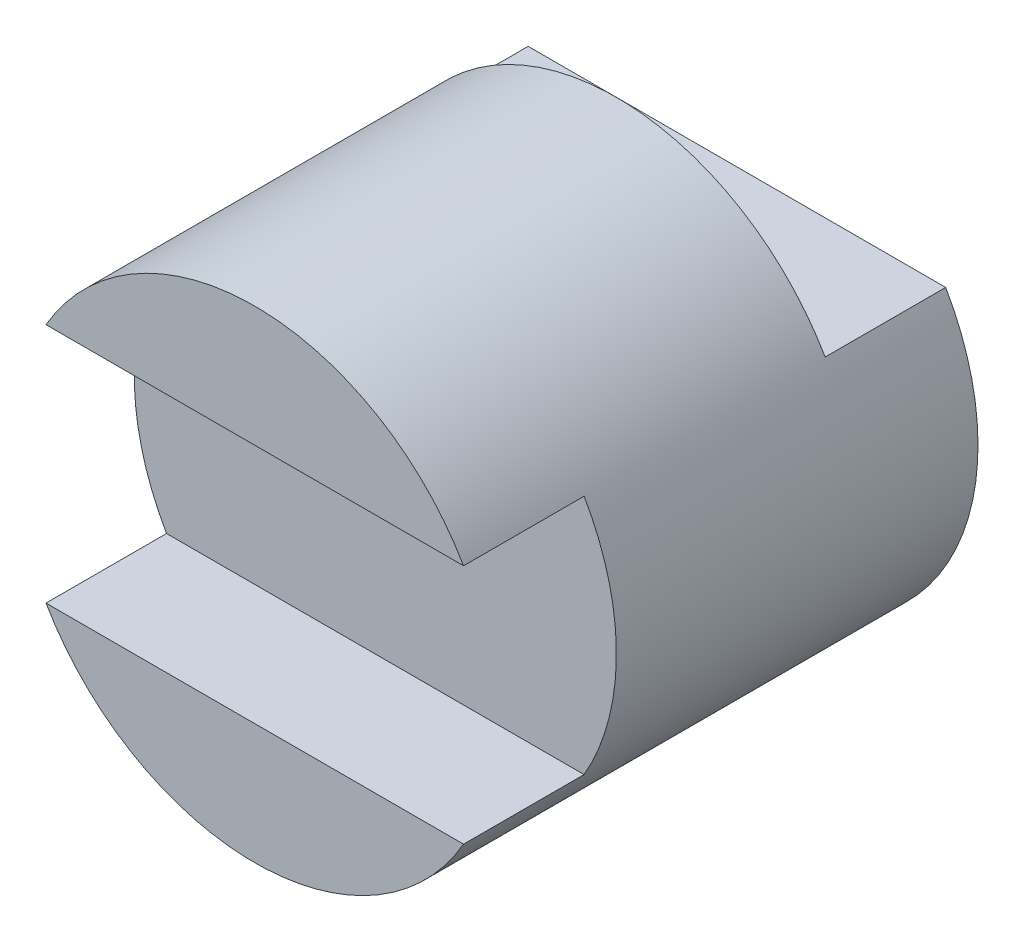
ISO-10303-21;
HEADER;
FILE_DESCRIPTION(('STEP AP214'),'2;1');
FILE_NAME('part.step','',(''),(''),'','','');
FILE_SCHEMA(('AUTOMOTIVE_DESIGN { 1 0 10303 214 1 1 1 1 }'));
ENDSEC;
DATA;
#1=APPLICATION_CONTEXT('core data for automotive mechanical design processes');
#2=APPLICATION_PROTOCOL_DEFINITION('international standard','automotive_design',2000,#1);
#3=PRODUCT_CONTEXT('',#1,'mechanical');
#4=PRODUCT('Part','Part','',(#3));
#5=PRODUCT_RELATED_PRODUCT_CATEGORY('part','',(#4));
#6=PRODUCT_DEFINITION_FORMATION('','',#4);
#7=PRODUCT_DEFINITION_CONTEXT('part definition',#1,'design');
#8=PRODUCT_DEFINITION('design','',#6,#7);
#9=PRODUCT_DEFINITION_SHAPE('','',#8);
#10=(LENGTH_UNIT() NAMED_UNIT(*) SI_UNIT(.MILLI.,.METRE.));
#11=(NAMED_UNIT(*) PLANE_ANGLE_UNIT() SI_UNIT($,.RADIAN.));
#12=(NAMED_UNIT(*) SI_UNIT($,.STERADIAN.) SOLID_ANGLE_UNIT());
#13=UNCERTAINTY_MEASURE_WITH_UNIT(LENGTH_MEASURE(1.E-05),#10,'distance_accuracy_value','');
#14=(GEOMETRIC_REPRESENTATION_CONTEXT(3) GLOBAL_UNCERTAINTY_ASSIGNED_CONTEXT((#13)) GLOBAL_UNIT_ASSIGNED_CONTEXT((#10,
#11,#12)) REPRESENTATION_CONTEXT('',''));
#15=CARTESIAN_POINT('',(0.,0.,0.));
#16=DIRECTION('',(0.,0.,1.));
#17=DIRECTION('',(1.,0.,0.));
#18=AXIS2_PLACEMENT_3D('',#15,#16,#17);
#19=CARTESIAN_POINT('',(0.,0.,3.));
#20=DIRECTION('',(0.,0.,1.));
#21=DIRECTION('',(1.,0.,0.));
#22=AXIS2_PLACEMENT_3D('',#19,#20,#21);
#23=PLANE('',#22);
#24=CARTESIAN_POINT('',(0.,0.,3.));
#25=DIRECTION('',(0.,0.,1.));
#26=DIRECTION('',(1.,0.,0.));
#27=AXIS2_PLACEMENT_3D('',#24,#25,#26);
#28=CIRCLE('',#27,2.);
#29=CARTESIAN_POINT('',(-1.73205080756888,1.,3.));
#30=VERTEX_POINT('',#29);
#31=CARTESIAN_POINT('',(-1.73205080756888,-1.,3.));
#32=VERTEX_POINT('',#31);
#33=EDGE_CURVE('E11',#30,#32,#28,.T.);
#34=ORIENTED_EDGE('',*,*,#33,.T.);
#35=DIRECTION('',(-1.,0.,0.));
#36=VECTOR('',#35,1.);
#37=CARTESIAN_POINT('',(1.73205080756888,-1.,3.));
#38=LINE('',#37,#36);
#39=CARTESIAN_POINT('',(1.73205080756888,-1.,3.));
#40=VERTEX_POINT('',#39);
#41=EDGE_CURVE('E97',#40,#32,#38,.T.);
#42=ORIENTED_EDGE('',*,*,#41,.F.);
#43=CARTESIAN_POINT('',(1.73205080756888,1.,3.));
#44=VERTEX_POINT('',#43);
#45=EDGE_CURVE('E42',#40,#44,#28,.T.);
#46=ORIENTED_EDGE('',*,*,#45,.T.);
#47=DIRECTION('',(1.,0.,0.));
#48=VECTOR('',#47,1.);
#49=CARTESIAN_POINT('',(-1.73205080756888,1.,3.));
#50=LINE('',#49,#48);
#51=EDGE_CURVE('E117',#30,#44,#50,.T.);
#52=ORIENTED_EDGE('',*,*,#51,.F.);
#53=EDGE_LOOP('',(#34,#42,#46,#52));
#54=FACE_BOUND('',#53,.T.);
#55=ADVANCED_FACE('F33',(#54),#23,.T.);
#56=CARTESIAN_POINT('',(0.,0.,3.));
#57=DIRECTION('',(0.,0.,-1.));
#58=DIRECTION('',(-1.,0.,0.));
#59=AXIS2_PLACEMENT_3D('',#56,#57,#58);
#60=CYLINDRICAL_SURFACE('',#59,2.);
#61=ORIENTED_EDGE('',*,*,#33,.F.);
#62=DIRECTION('',(0.,0.,-1.));
#63=VECTOR('',#62,1.);
#64=CARTESIAN_POINT('',(-1.73205080756888,1.,4.));
#65=LINE('',#64,#63);
#66=CARTESIAN_POINT('',(-1.73205080756888,1.,4.));
#67=VERTEX_POINT('',#66);
#68=EDGE_CURVE('E128',#67,#30,#65,.T.);
#69=ORIENTED_EDGE('',*,*,#68,.F.);
#70=CARTESIAN_POINT('',(0.,0.,4.));
#71=DIRECTION('',(0.,0.,1.));
#72=DIRECTION('',(-1.,0.,0.));
#73=AXIS2_PLACEMENT_3D('',#70,#71,#72);
#74=CIRCLE('',#73,2.);
#75=CARTESIAN_POINT('',(1.73205080756888,1.,4.));
#76=VERTEX_POINT('',#75);
#77=EDGE_CURVE('E119',#76,#67,#74,.T.);
#78=ORIENTED_EDGE('',*,*,#77,.F.);
#79=DIRECTION('',(0.,0.,-1.));
#80=VECTOR('',#79,1.);
#81=CARTESIAN_POINT('',(1.73205080756888,1.,4.));
#82=LINE('',#81,#80);
#83=EDGE_CURVE('E124',#76,#44,#82,.T.);
#84=ORIENTED_EDGE('',*,*,#83,.T.);
#85=ORIENTED_EDGE('',*,*,#45,.F.);
#86=DIRECTION('',(0.,0.,-1.));
#87=VECTOR('',#86,1.);
#88=CARTESIAN_POINT('',(1.73205080756888,-1.,4.));
#89=LINE('',#88,#87);
#90=CARTESIAN_POINT('',(1.73205080756888,-1.,4.));
#91=VERTEX_POINT('',#90);
#92=EDGE_CURVE('E49',#91,#40,#89,.T.);
#93=ORIENTED_EDGE('',*,*,#92,.F.);
#94=CARTESIAN_POINT('',(0.,0.,4.));
#95=DIRECTION('',(0.,0.,1.));
#96=DIRECTION('',(1.,0.,0.));
#97=AXIS2_PLACEMENT_3D('',#94,#95,#96);
#98=CIRCLE('',#97,2.);
#99=CARTESIAN_POINT('',(-1.73205080756888,-1.,4.));
#100=VERTEX_POINT('',#99);
#101=EDGE_CURVE('E93',#100,#91,#98,.T.);
#102=ORIENTED_EDGE('',*,*,#101,.F.);
#103=DIRECTION('',(0.,0.,-1.));
#104=VECTOR('',#103,1.);
#105=CARTESIAN_POINT('',(-1.73205080756888,-1.,4.));
#106=LINE('',#105,#104);
#107=EDGE_CURVE('E90',#100,#32,#106,.T.);
#108=ORIENTED_EDGE('',*,*,#107,.T.);
#109=EDGE_LOOP('',(#61,#69,#78,#84,#85,#93,#102,#108));
#110=FACE_BOUND('',#109,.T.);
#111=CARTESIAN_POINT('',(0.,0.,1.));
#112=DIRECTION('',(0.,0.,-1.));
#113=DIRECTION('',(-1.,0.,0.));
#114=AXIS2_PLACEMENT_3D('',#111,#112,#113);
#115=CIRCLE('',#114,2.);
#116=CARTESIAN_POINT('',(-1.73205080756888,1.,1.));
#117=VERTEX_POINT('',#116);
#118=CARTESIAN_POINT('',(1.73205080756888,1.,1.));
#119=VERTEX_POINT('',#118);
#120=EDGE_CURVE('E105',#117,#119,#115,.T.);
#121=ORIENTED_EDGE('',*,*,#120,.F.);
#122=DIRECTION('',(0.,0.,-1.));
#123=VECTOR('',#122,1.);
#124=CARTESIAN_POINT('',(-1.73205080756888,1.,1.));
#125=LINE('',#124,#123);
#126=CARTESIAN_POINT('',(-1.73205080756888,1.,0.));
#127=VERTEX_POINT('',#126);
#128=EDGE_CURVE('E114',#117,#127,#125,.T.);
#129=ORIENTED_EDGE('',*,*,#128,.T.);
#130=CARTESIAN_POINT('',(0.,0.,0.));
#131=DIRECTION('',(0.,0.,1.));
#132=DIRECTION('',(1.,0.,0.));
#133=AXIS2_PLACEMENT_3D('',#130,#131,#132);
#134=CIRCLE('',#133,2.);
#135=CARTESIAN_POINT('',(1.73205080756888,1.,0.));
#136=VERTEX_POINT('',#135);
#137=EDGE_CURVE('E37',#127,#136,#134,.T.);
#138=ORIENTED_EDGE('',*,*,#137,.T.);
#139=DIRECTION('',(0.,0.,-1.));
#140=VECTOR('',#139,1.);
#141=CARTESIAN_POINT('',(1.73205080756888,1.,1.));
#142=LINE('',#141,#140);
#143=EDGE_CURVE('E57',#119,#136,#142,.T.);
#144=ORIENTED_EDGE('',*,*,#143,.F.);
#145=EDGE_LOOP('',(#121,#129,#138,#144));
#146=FACE_BOUND('',#145,.T.);
#147=ADVANCED_FACE('F35',(#110,#146),#60,.T.);
#148=CARTESIAN_POINT('',(0.,0.,0.));
#149=DIRECTION('',(0.,0.,1.));
#150=DIRECTION('',(1.,0.,0.));
#151=AXIS2_PLACEMENT_3D('',#148,#149,#150);
#152=PLANE('',#151);
#153=ORIENTED_EDGE('',*,*,#137,.F.);
#154=DIRECTION('',(-1.,0.,0.));
#155=VECTOR('',#154,1.);
#156=CARTESIAN_POINT('',(-1.73205080756888,1.,0.));
#157=LINE('',#156,#155);
#158=EDGE_CURVE('E103',#136,#127,#157,.T.);
#159=ORIENTED_EDGE('',*,*,#158,.F.);
#160=EDGE_LOOP('',(#153,#159));
#161=FACE_BOUND('',#160,.T.);
#162=ADVANCED_FACE('F149',(#161),#152,.F.);
#163=CARTESIAN_POINT('',(-1.73205080756888,1.,4.));
#164=DIRECTION('',(0.,1.,0.));
#165=DIRECTION('',(0.,0.,1.));
#166=AXIS2_PLACEMENT_3D('',#163,#164,#165);
#167=PLANE('',#166);
#168=ORIENTED_EDGE('',*,*,#51,.T.);
#169=ORIENTED_EDGE('',*,*,#83,.F.);
#170=DIRECTION('',(1.,0.,0.));
#171=VECTOR('',#170,1.);
#172=CARTESIAN_POINT('',(-1.73205080756888,1.,4.));
#173=LINE('',#172,#171);
#174=EDGE_CURVE('E122',#67,#76,#173,.T.);
#175=ORIENTED_EDGE('',*,*,#174,.F.);
#176=ORIENTED_EDGE('',*,*,#68,.T.);
#177=EDGE_LOOP('',(#168,#169,#175,#176));
#178=FACE_BOUND('',#177,.T.);
#179=ADVANCED_FACE('F136',(#178),#167,.F.);
#180=CARTESIAN_POINT('',(0.,0.,4.));
#181=DIRECTION('',(0.,0.,-1.));
#182=DIRECTION('',(-1.,0.,0.));
#183=AXIS2_PLACEMENT_3D('',#180,#181,#182);
#184=PLANE('',#183);
#185=ORIENTED_EDGE('',*,*,#77,.T.);
#186=ORIENTED_EDGE('',*,*,#174,.T.);
#187=EDGE_LOOP('',(#185,#186));
#188=FACE_BOUND('',#187,.T.);
#189=ADVANCED_FACE('F139',(#188),#184,.F.);
#190=CARTESIAN_POINT('',(-1.73205080756888,1.,1.));
#191=DIRECTION('',(0.,-1.,0.));
#192=DIRECTION('',(1.,0.,0.));
#193=AXIS2_PLACEMENT_3D('',#190,#191,#192);
#194=PLANE('',#193);
#195=ORIENTED_EDGE('',*,*,#158,.T.);
#196=ORIENTED_EDGE('',*,*,#128,.F.);
#197=DIRECTION('',(-1.,0.,0.));
#198=VECTOR('',#197,1.);
#199=CARTESIAN_POINT('',(-1.73205080756888,1.,1.));
#200=LINE('',#199,#198);
#201=EDGE_CURVE('E111',#119,#117,#200,.T.);
#202=ORIENTED_EDGE('',*,*,#201,.F.);
#203=ORIENTED_EDGE('',*,*,#143,.T.);
#204=EDGE_LOOP('',(#195,#196,#202,#203));
#205=FACE_BOUND('',#204,.T.);
#206=ADVANCED_FACE('F141',(#205),#194,.F.);
#207=CARTESIAN_POINT('',(0.,0.,1.));
#208=DIRECTION('',(0.,0.,-1.));
#209=DIRECTION('',(-1.,0.,0.));
#210=AXIS2_PLACEMENT_3D('',#207,#208,#209);
#211=PLANE('',#210);
#212=ORIENTED_EDGE('',*,*,#120,.T.);
#213=ORIENTED_EDGE('',*,*,#201,.T.);
#214=EDGE_LOOP('',(#212,#213));
#215=FACE_BOUND('',#214,.T.);
#216=ADVANCED_FACE('F147',(#215),#211,.T.);
#217=CARTESIAN_POINT('',(1.73205080756888,-1.,4.));
#218=DIRECTION('',(0.,-1.,0.));
#219=DIRECTION('',(0.,0.,-1.));
#220=AXIS2_PLACEMENT_3D('',#217,#218,#219);
#221=PLANE('',#220);
#222=ORIENTED_EDGE('',*,*,#41,.T.);
#223=ORIENTED_EDGE('',*,*,#107,.F.);
#224=DIRECTION('',(-1.,0.,0.));
#225=VECTOR('',#224,1.);
#226=CARTESIAN_POINT('',(1.73205080756888,-1.,4.));
#227=LINE('',#226,#225);
#228=EDGE_CURVE('E86',#91,#100,#227,.T.);
#229=ORIENTED_EDGE('',*,*,#228,.F.);
#230=ORIENTED_EDGE('',*,*,#92,.T.);
#231=EDGE_LOOP('',(#222,#223,#229,#230));
#232=FACE_BOUND('',#231,.T.);
#233=ADVANCED_FACE('F88',(#232),#221,.F.);
#234=CARTESIAN_POINT('',(0.,0.,4.));
#235=DIRECTION('',(0.,0.,1.));
#236=DIRECTION('',(1.,0.,0.));
#237=AXIS2_PLACEMENT_3D('',#234,#235,#236);
#238=PLANE('',#237);
#239=ORIENTED_EDGE('',*,*,#101,.T.);
#240=ORIENTED_EDGE('',*,*,#228,.T.);
#241=EDGE_LOOP('',(#239,#240));
#242=FACE_BOUND('',#241,.T.);
#243=ADVANCED_FACE('F95',(#242),#238,.T.);
#244=CLOSED_SHELL('',(#55,#147,#162,#179,#189,#206,#216,#233,#243));
#245=MANIFOLD_SOLID_BREP('B2',#244);
#246=ADVANCED_BREP_SHAPE_REPRESENTATION('',(#18,#245),#14);
#247=SHAPE_DEFINITION_REPRESENTATION(#9,#246);
ENDSEC;
END-ISO-10303-21;
